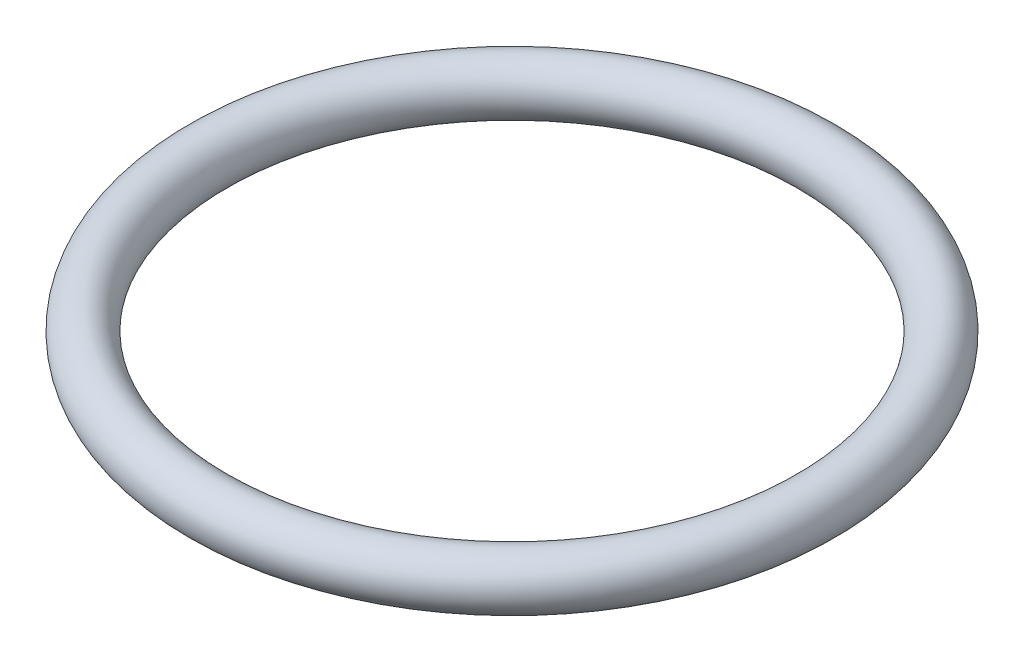
ISO-10303-21;
HEADER;
FILE_DESCRIPTION(('STEP AP214'),'2;1');
FILE_NAME('part.step','',(''),(''),'','','');
FILE_SCHEMA(('AUTOMOTIVE_DESIGN { 1 0 10303 214 1 1 1 1 }'));
ENDSEC;
DATA;
#1=APPLICATION_CONTEXT('core data for automotive mechanical design processes');
#2=APPLICATION_PROTOCOL_DEFINITION('international standard','automotive_design',2000,#1);
#3=PRODUCT_CONTEXT('',#1,'mechanical');
#4=PRODUCT('Part','Part','',(#3));
#5=PRODUCT_RELATED_PRODUCT_CATEGORY('part','',(#4));
#6=PRODUCT_DEFINITION_FORMATION('','',#4);
#7=PRODUCT_DEFINITION_CONTEXT('part definition',#1,'design');
#8=PRODUCT_DEFINITION('design','',#6,#7);
#9=PRODUCT_DEFINITION_SHAPE('','',#8);
#10=(LENGTH_UNIT() NAMED_UNIT(*) SI_UNIT(.MILLI.,.METRE.));
#11=(NAMED_UNIT(*) PLANE_ANGLE_UNIT() SI_UNIT($,.RADIAN.));
#12=(NAMED_UNIT(*) SI_UNIT($,.STERADIAN.) SOLID_ANGLE_UNIT());
#13=UNCERTAINTY_MEASURE_WITH_UNIT(LENGTH_MEASURE(1.E-05),#10,'distance_accuracy_value','');
#14=(GEOMETRIC_REPRESENTATION_CONTEXT(3) GLOBAL_UNCERTAINTY_ASSIGNED_CONTEXT((#13)) GLOBAL_UNIT_ASSIGNED_CONTEXT((#10,
#11,#12)) REPRESENTATION_CONTEXT('',''));
#15=CARTESIAN_POINT('',(0.,0.,0.));
#16=DIRECTION('',(0.,0.,1.));
#17=DIRECTION('',(1.,0.,0.));
#18=AXIS2_PLACEMENT_3D('',#15,#16,#17);
#19=CARTESIAN_POINT('',(0.,0.,0.));
#20=DIRECTION('',(0.,-1.,0.));
#21=DIRECTION('',(0.,0.,-1.));
#22=AXIS2_PLACEMENT_3D('',#19,#20,#21);
#23=TOROIDAL_SURFACE('',#22,29.,2.5);
#24=CARTESIAN_POINT('',(0.,0.,-31.5));
#25=VERTEX_POINT('',#24);
#26=VERTEX_LOOP('',#25);
#27=FACE_BOUND('',#26,.T.);
#28=ADVANCED_FACE('F28',(#27),#23,.T.);
#29=CLOSED_SHELL('',(#28));
#30=MANIFOLD_SOLID_BREP('B2',#29);
#31=ADVANCED_BREP_SHAPE_REPRESENTATION('',(#18,#30),#14);
#32=SHAPE_DEFINITION_REPRESENTATION(#9,#31);
ENDSEC;
END-ISO-10303-21;
